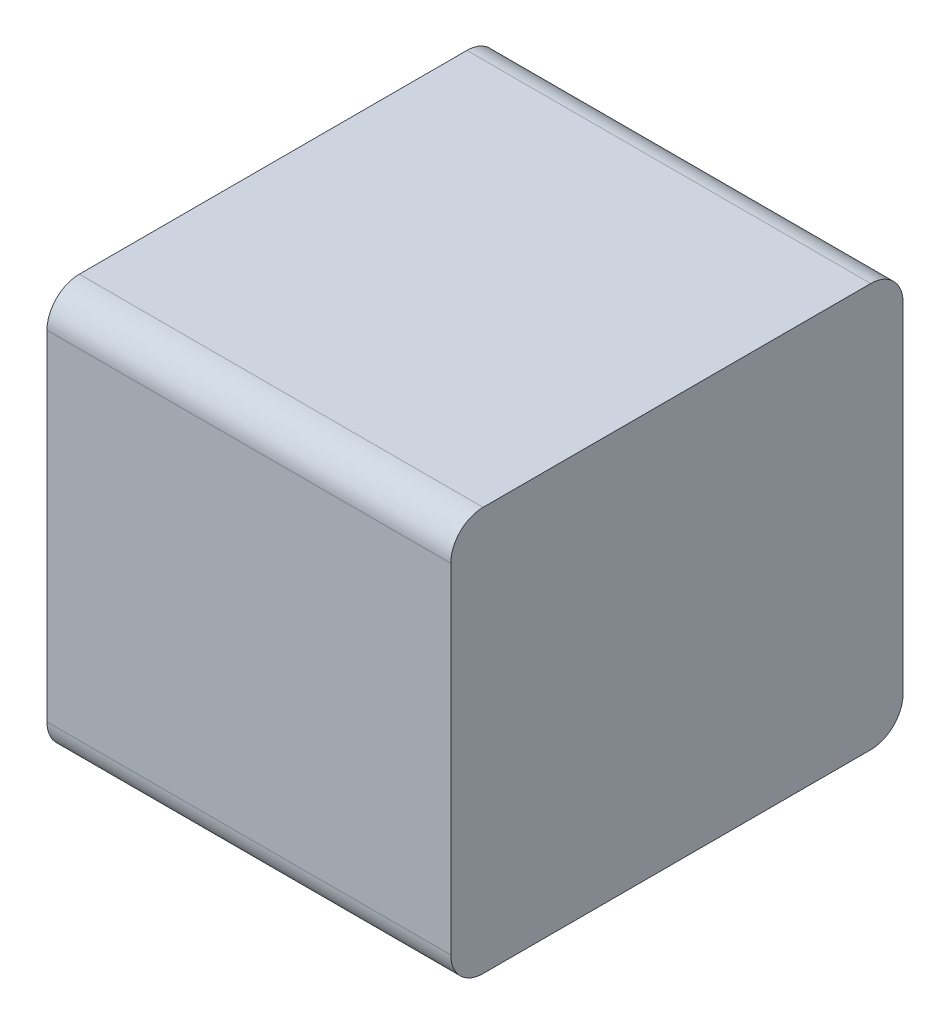
ISO-10303-21;
HEADER;
FILE_DESCRIPTION(('STEP AP214'),'2;1');
FILE_NAME('part.step','',(''),(''),'','','');
FILE_SCHEMA(('AUTOMOTIVE_DESIGN { 1 0 10303 214 1 1 1 1 }'));
ENDSEC;
DATA;
#1=APPLICATION_CONTEXT('core data for automotive mechanical design processes');
#2=APPLICATION_PROTOCOL_DEFINITION('international standard','automotive_design',2000,#1);
#3=PRODUCT_CONTEXT('',#1,'mechanical');
#4=PRODUCT('Part','Part','',(#3));
#5=PRODUCT_RELATED_PRODUCT_CATEGORY('part','',(#4));
#6=PRODUCT_DEFINITION_FORMATION('','',#4);
#7=PRODUCT_DEFINITION_CONTEXT('part definition',#1,'design');
#8=PRODUCT_DEFINITION('design','',#6,#7);
#9=PRODUCT_DEFINITION_SHAPE('','',#8);
#10=(LENGTH_UNIT() NAMED_UNIT(*) SI_UNIT(.MILLI.,.METRE.));
#11=(NAMED_UNIT(*) PLANE_ANGLE_UNIT() SI_UNIT($,.RADIAN.));
#12=(NAMED_UNIT(*) SI_UNIT($,.STERADIAN.) SOLID_ANGLE_UNIT());
#13=UNCERTAINTY_MEASURE_WITH_UNIT(LENGTH_MEASURE(1.E-05),#10,'distance_accuracy_value','');
#14=(GEOMETRIC_REPRESENTATION_CONTEXT(3) GLOBAL_UNCERTAINTY_ASSIGNED_CONTEXT((#13)) GLOBAL_UNIT_ASSIGNED_CONTEXT((#10,
#11,#12)) REPRESENTATION_CONTEXT('',''));
#15=CARTESIAN_POINT('',(0.,0.,0.));
#16=DIRECTION('',(0.,0.,1.));
#17=DIRECTION('',(1.,0.,0.));
#18=AXIS2_PLACEMENT_3D('',#15,#16,#17);
#19=CARTESIAN_POINT('',(0.25,0.,0.28));
#20=DIRECTION('',(1.,0.,0.));
#21=DIRECTION('',(0.,0.,-1.));
#22=AXIS2_PLACEMENT_3D('',#19,#20,#21);
#23=PLANE('',#22);
#24=CARTESIAN_POINT('',(0.25,0.21,0.04));
#25=DIRECTION('',(1.,0.,0.));
#26=DIRECTION('',(0.,0.,-1.));
#27=AXIS2_PLACEMENT_3D('',#24,#25,#26);
#28=CIRCLE('',#27,0.04);
#29=CARTESIAN_POINT('',(0.25,0.21,0.));
#30=VERTEX_POINT('',#29);
#31=CARTESIAN_POINT('',(0.25,0.25,0.04));
#32=VERTEX_POINT('',#31);
#33=EDGE_CURVE('E11',#30,#32,#28,.T.);
#34=ORIENTED_EDGE('',*,*,#33,.T.);
#35=DIRECTION('',(0.,0.,1.));
#36=VECTOR('',#35,1.);
#37=CARTESIAN_POINT('',(0.25,0.25,0.04));
#38=LINE('',#37,#36);
#39=CARTESIAN_POINT('',(0.25,0.25,0.52));
#40=VERTEX_POINT('',#39);
#41=EDGE_CURVE('E24',#32,#40,#38,.T.);
#42=ORIENTED_EDGE('',*,*,#41,.T.);
#43=CARTESIAN_POINT('',(0.25,0.21,0.52));
#44=DIRECTION('',(1.,0.,0.));
#45=DIRECTION('',(0.,1.,0.));
#46=AXIS2_PLACEMENT_3D('',#43,#44,#45);
#47=CIRCLE('',#46,0.04);
#48=CARTESIAN_POINT('',(0.25,0.21,0.56));
#49=VERTEX_POINT('',#48);
#50=EDGE_CURVE('E141',#40,#49,#47,.T.);
#51=ORIENTED_EDGE('',*,*,#50,.T.);
#52=DIRECTION('',(0.,-1.,0.));
#53=VECTOR('',#52,1.);
#54=CARTESIAN_POINT('',(0.25,0.21,0.56));
#55=LINE('',#54,#53);
#56=CARTESIAN_POINT('',(0.25,-0.21,0.56));
#57=VERTEX_POINT('',#56);
#58=EDGE_CURVE('E139',#49,#57,#55,.T.);
#59=ORIENTED_EDGE('',*,*,#58,.T.);
#60=CARTESIAN_POINT('',(0.25,-0.21,0.52));
#61=DIRECTION('',(1.,0.,0.));
#62=DIRECTION('',(0.,0.,1.));
#63=AXIS2_PLACEMENT_3D('',#60,#61,#62);
#64=CIRCLE('',#63,0.04);
#65=CARTESIAN_POINT('',(0.25,-0.25,0.52));
#66=VERTEX_POINT('',#65);
#67=EDGE_CURVE('E137',#57,#66,#64,.T.);
#68=ORIENTED_EDGE('',*,*,#67,.T.);
#69=DIRECTION('',(0.,0.,-1.));
#70=VECTOR('',#69,1.);
#71=CARTESIAN_POINT('',(0.25,-0.25,0.52));
#72=LINE('',#71,#70);
#73=CARTESIAN_POINT('',(0.25,-0.25,0.04));
#74=VERTEX_POINT('',#73);
#75=EDGE_CURVE('E135',#66,#74,#72,.T.);
#76=ORIENTED_EDGE('',*,*,#75,.T.);
#77=CARTESIAN_POINT('',(0.25,-0.21,0.04));
#78=DIRECTION('',(1.,0.,0.));
#79=DIRECTION('',(0.,-1.,0.));
#80=AXIS2_PLACEMENT_3D('',#77,#78,#79);
#81=CIRCLE('',#80,0.04);
#82=CARTESIAN_POINT('',(0.25,-0.21,0.));
#83=VERTEX_POINT('',#82);
#84=EDGE_CURVE('E133',#74,#83,#81,.T.);
#85=ORIENTED_EDGE('',*,*,#84,.T.);
#86=DIRECTION('',(0.,1.,0.));
#87=VECTOR('',#86,1.);
#88=CARTESIAN_POINT('',(0.25,-0.21,0.));
#89=LINE('',#88,#87);
#90=EDGE_CURVE('E131',#83,#30,#89,.T.);
#91=ORIENTED_EDGE('',*,*,#90,.T.);
#92=EDGE_LOOP('',(#34,#42,#51,#59,#68,#76,#85,#91));
#93=FACE_BOUND('',#92,.T.);
#94=ADVANCED_FACE('F17',(#93),#23,.T.);
#95=CARTESIAN_POINT('',(0.,0.25,0.52));
#96=DIRECTION('',(0.,1.,0.));
#97=DIRECTION('',(0.,0.,-1.));
#98=AXIS2_PLACEMENT_3D('',#95,#96,#97);
#99=PLANE('',#98);
#100=DIRECTION('',(1.,0.,0.));
#101=VECTOR('',#100,1.);
#102=CARTESIAN_POINT('',(0.,0.25,0.04));
#103=LINE('',#102,#101);
#104=CARTESIAN_POINT('',(-0.25,0.25,0.04));
#105=VERTEX_POINT('',#104);
#106=EDGE_CURVE('E129',#105,#32,#103,.T.);
#107=ORIENTED_EDGE('',*,*,#106,.F.);
#108=DIRECTION('',(0.,0.,-1.));
#109=VECTOR('',#108,1.);
#110=CARTESIAN_POINT('',(-0.25,0.25,0.04));
#111=LINE('',#110,#109);
#112=CARTESIAN_POINT('',(-0.25,0.25,0.52));
#113=VERTEX_POINT('',#112);
#114=EDGE_CURVE('E96',#113,#105,#111,.T.);
#115=ORIENTED_EDGE('',*,*,#114,.F.);
#116=DIRECTION('',(1.,0.,0.));
#117=VECTOR('',#116,1.);
#118=CARTESIAN_POINT('',(0.,0.25,0.52));
#119=LINE('',#118,#117);
#120=EDGE_CURVE('E125',#113,#40,#119,.T.);
#121=ORIENTED_EDGE('',*,*,#120,.T.);
#122=ORIENTED_EDGE('',*,*,#41,.F.);
#123=EDGE_LOOP('',(#107,#115,#121,#122));
#124=FACE_BOUND('',#123,.T.);
#125=ADVANCED_FACE('F149',(#124),#99,.T.);
#126=CARTESIAN_POINT('',(0.,0.21,0.52));
#127=DIRECTION('',(-1.,0.,0.));
#128=DIRECTION('',(0.,1.,0.));
#129=AXIS2_PLACEMENT_3D('',#126,#127,#128);
#130=CYLINDRICAL_SURFACE('',#129,0.04);
#131=ORIENTED_EDGE('',*,*,#120,.F.);
#132=CARTESIAN_POINT('',(-0.25,0.21,0.52));
#133=DIRECTION('',(-1.,0.,0.));
#134=DIRECTION('',(0.,1.,0.));
#135=AXIS2_PLACEMENT_3D('',#132,#133,#134);
#136=CIRCLE('',#135,0.04);
#137=CARTESIAN_POINT('',(-0.25,0.21,0.56));
#138=VERTEX_POINT('',#137);
#139=EDGE_CURVE('E123',#138,#113,#136,.T.);
#140=ORIENTED_EDGE('',*,*,#139,.F.);
#141=DIRECTION('',(1.,0.,0.));
#142=VECTOR('',#141,1.);
#143=CARTESIAN_POINT('',(0.,0.21,0.56));
#144=LINE('',#143,#142);
#145=EDGE_CURVE('E120',#138,#49,#144,.T.);
#146=ORIENTED_EDGE('',*,*,#145,.T.);
#147=ORIENTED_EDGE('',*,*,#50,.F.);
#148=EDGE_LOOP('',(#131,#140,#146,#147));
#149=FACE_BOUND('',#148,.T.);
#150=ADVANCED_FACE('F147',(#149),#130,.T.);
#151=CARTESIAN_POINT('',(0.,-0.21,0.56));
#152=DIRECTION('',(0.,0.,1.));
#153=DIRECTION('',(0.,1.,0.));
#154=AXIS2_PLACEMENT_3D('',#151,#152,#153);
#155=PLANE('',#154);
#156=ORIENTED_EDGE('',*,*,#145,.F.);
#157=DIRECTION('',(0.,1.,0.));
#158=VECTOR('',#157,1.);
#159=CARTESIAN_POINT('',(-0.25,0.21,0.56));
#160=LINE('',#159,#158);
#161=CARTESIAN_POINT('',(-0.25,-0.21,0.56));
#162=VERTEX_POINT('',#161);
#163=EDGE_CURVE('E117',#162,#138,#160,.T.);
#164=ORIENTED_EDGE('',*,*,#163,.F.);
#165=DIRECTION('',(1.,0.,0.));
#166=VECTOR('',#165,1.);
#167=CARTESIAN_POINT('',(0.,-0.21,0.56));
#168=LINE('',#167,#166);
#169=EDGE_CURVE('E114',#162,#57,#168,.T.);
#170=ORIENTED_EDGE('',*,*,#169,.T.);
#171=ORIENTED_EDGE('',*,*,#58,.F.);
#172=EDGE_LOOP('',(#156,#164,#170,#171));
#173=FACE_BOUND('',#172,.T.);
#174=ADVANCED_FACE('F156',(#173),#155,.T.);
#175=CARTESIAN_POINT('',(0.,-0.21,0.52));
#176=DIRECTION('',(-1.,0.,0.));
#177=DIRECTION('',(0.,0.,1.));
#178=AXIS2_PLACEMENT_3D('',#175,#176,#177);
#179=CYLINDRICAL_SURFACE('',#178,0.04);
#180=ORIENTED_EDGE('',*,*,#169,.F.);
#181=CARTESIAN_POINT('',(-0.25,-0.21,0.52));
#182=DIRECTION('',(-1.,0.,0.));
#183=DIRECTION('',(0.,0.,1.));
#184=AXIS2_PLACEMENT_3D('',#181,#182,#183);
#185=CIRCLE('',#184,0.04);
#186=CARTESIAN_POINT('',(-0.25,-0.25,0.52));
#187=VERTEX_POINT('',#186);
#188=EDGE_CURVE('E111',#187,#162,#185,.T.);
#189=ORIENTED_EDGE('',*,*,#188,.F.);
#190=DIRECTION('',(1.,0.,0.));
#191=VECTOR('',#190,1.);
#192=CARTESIAN_POINT('',(0.,-0.25,0.52));
#193=LINE('',#192,#191);
#194=EDGE_CURVE('E108',#187,#66,#193,.T.);
#195=ORIENTED_EDGE('',*,*,#194,.T.);
#196=ORIENTED_EDGE('',*,*,#67,.F.);
#197=EDGE_LOOP('',(#180,#189,#195,#196));
#198=FACE_BOUND('',#197,.T.);
#199=ADVANCED_FACE('F161',(#198),#179,.T.);
#200=CARTESIAN_POINT('',(0.,-0.25,0.04));
#201=DIRECTION('',(0.,-1.,0.));
#202=DIRECTION('',(0.,0.,1.));
#203=AXIS2_PLACEMENT_3D('',#200,#201,#202);
#204=PLANE('',#203);
#205=ORIENTED_EDGE('',*,*,#194,.F.);
#206=DIRECTION('',(0.,0.,1.));
#207=VECTOR('',#206,1.);
#208=CARTESIAN_POINT('',(-0.25,-0.25,0.52));
#209=LINE('',#208,#207);
#210=CARTESIAN_POINT('',(-0.25,-0.25,0.04));
#211=VERTEX_POINT('',#210);
#212=EDGE_CURVE('E105',#211,#187,#209,.T.);
#213=ORIENTED_EDGE('',*,*,#212,.F.);
#214=DIRECTION('',(1.,0.,0.));
#215=VECTOR('',#214,1.);
#216=CARTESIAN_POINT('',(0.,-0.25,0.04));
#217=LINE('',#216,#215);
#218=EDGE_CURVE('E102',#211,#74,#217,.T.);
#219=ORIENTED_EDGE('',*,*,#218,.T.);
#220=ORIENTED_EDGE('',*,*,#75,.F.);
#221=EDGE_LOOP('',(#205,#213,#219,#220));
#222=FACE_BOUND('',#221,.T.);
#223=ADVANCED_FACE('F165',(#222),#204,.T.);
#224=CARTESIAN_POINT('',(0.,-0.21,0.04));
#225=DIRECTION('',(-1.,0.,0.));
#226=DIRECTION('',(0.,-1.,0.));
#227=AXIS2_PLACEMENT_3D('',#224,#225,#226);
#228=CYLINDRICAL_SURFACE('',#227,0.04);
#229=ORIENTED_EDGE('',*,*,#218,.F.);
#230=CARTESIAN_POINT('',(-0.25,-0.21,0.04));
#231=DIRECTION('',(-1.,0.,0.));
#232=DIRECTION('',(0.,-1.,0.));
#233=AXIS2_PLACEMENT_3D('',#230,#231,#232);
#234=CIRCLE('',#233,0.04);
#235=CARTESIAN_POINT('',(-0.25,-0.21,0.));
#236=VERTEX_POINT('',#235);
#237=EDGE_CURVE('E100',#236,#211,#234,.T.);
#238=ORIENTED_EDGE('',*,*,#237,.F.);
#239=DIRECTION('',(1.,0.,0.));
#240=VECTOR('',#239,1.);
#241=CARTESIAN_POINT('',(0.,-0.21,0.));
#242=LINE('',#241,#240);
#243=EDGE_CURVE('E84',#236,#83,#242,.T.);
#244=ORIENTED_EDGE('',*,*,#243,.T.);
#245=ORIENTED_EDGE('',*,*,#84,.F.);
#246=EDGE_LOOP('',(#229,#238,#244,#245));
#247=FACE_BOUND('',#246,.T.);
#248=ADVANCED_FACE('F169',(#247),#228,.T.);
#249=CARTESIAN_POINT('',(0.,0.21,0.));
#250=DIRECTION('',(0.,0.,-1.));
#251=DIRECTION('',(0.,-1.,0.));
#252=AXIS2_PLACEMENT_3D('',#249,#250,#251);
#253=PLANE('',#252);
#254=ORIENTED_EDGE('',*,*,#243,.F.);
#255=DIRECTION('',(0.,-1.,0.));
#256=VECTOR('',#255,1.);
#257=CARTESIAN_POINT('',(-0.25,-0.21,0.));
#258=LINE('',#257,#256);
#259=CARTESIAN_POINT('',(-0.25,0.21,0.));
#260=VERTEX_POINT('',#259);
#261=EDGE_CURVE('E79',#260,#236,#258,.T.);
#262=ORIENTED_EDGE('',*,*,#261,.F.);
#263=DIRECTION('',(-1.,0.,0.));
#264=VECTOR('',#263,1.);
#265=CARTESIAN_POINT('',(0.,0.21,0.));
#266=LINE('',#265,#264);
#267=EDGE_CURVE('E82',#30,#260,#266,.T.);
#268=ORIENTED_EDGE('',*,*,#267,.F.);
#269=ORIENTED_EDGE('',*,*,#90,.F.);
#270=EDGE_LOOP('',(#254,#262,#268,#269));
#271=FACE_BOUND('',#270,.T.);
#272=ADVANCED_FACE('F80',(#271),#253,.T.);
#273=CARTESIAN_POINT('',(0.,0.21,0.04));
#274=DIRECTION('',(-1.,0.,0.));
#275=DIRECTION('',(0.,0.,-1.));
#276=AXIS2_PLACEMENT_3D('',#273,#274,#275);
#277=CYLINDRICAL_SURFACE('',#276,0.04);
#278=ORIENTED_EDGE('',*,*,#267,.T.);
#279=CARTESIAN_POINT('',(-0.25,0.21,0.04));
#280=DIRECTION('',(-1.,0.,0.));
#281=DIRECTION('',(0.,0.,-1.));
#282=AXIS2_PLACEMENT_3D('',#279,#280,#281);
#283=CIRCLE('',#282,0.04);
#284=EDGE_CURVE('E91',#105,#260,#283,.T.);
#285=ORIENTED_EDGE('',*,*,#284,.F.);
#286=ORIENTED_EDGE('',*,*,#106,.T.);
#287=ORIENTED_EDGE('',*,*,#33,.F.);
#288=EDGE_LOOP('',(#278,#285,#286,#287));
#289=FACE_BOUND('',#288,.T.);
#290=ADVANCED_FACE('F90',(#289),#277,.T.);
#291=CARTESIAN_POINT('',(-0.25,0.,0.28));
#292=DIRECTION('',(1.,0.,0.));
#293=DIRECTION('',(0.,0.,-1.));
#294=AXIS2_PLACEMENT_3D('',#291,#292,#293);
#295=PLANE('',#294);
#296=ORIENTED_EDGE('',*,*,#284,.T.);
#297=ORIENTED_EDGE('',*,*,#261,.T.);
#298=ORIENTED_EDGE('',*,*,#237,.T.);
#299=ORIENTED_EDGE('',*,*,#212,.T.);
#300=ORIENTED_EDGE('',*,*,#188,.T.);
#301=ORIENTED_EDGE('',*,*,#163,.T.);
#302=ORIENTED_EDGE('',*,*,#139,.T.);
#303=ORIENTED_EDGE('',*,*,#114,.T.);
#304=EDGE_LOOP('',(#296,#297,#298,#299,#300,#301,#302,#303));
#305=FACE_BOUND('',#304,.T.);
#306=ADVANCED_FACE('F94',(#305),#295,.F.);
#307=CLOSED_SHELL('',(#94,#125,#150,#174,#199,#223,#248,#272,#290,#306));
#308=MANIFOLD_SOLID_BREP('B1',#307);
#309=ADVANCED_BREP_SHAPE_REPRESENTATION('',(#18,#308),#14);
#310=SHAPE_DEFINITION_REPRESENTATION(#9,#309);
ENDSEC;
END-ISO-10303-21;
